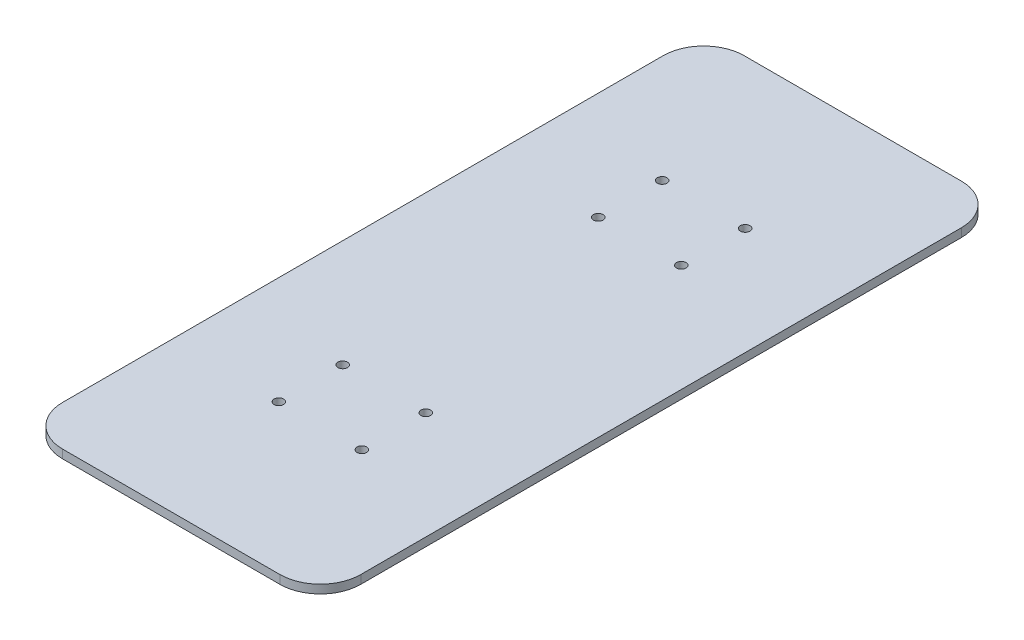
ISO-10303-21;
HEADER;
FILE_DESCRIPTION(('STEP AP214'),'2;1');
FILE_NAME('part.step','',(''),(''),'','','');
FILE_SCHEMA(('AUTOMOTIVE_DESIGN { 1 0 10303 214 1 1 1 1 }'));
ENDSEC;
DATA;
#1=APPLICATION_CONTEXT('core data for automotive mechanical design processes');
#2=APPLICATION_PROTOCOL_DEFINITION('international standard','automotive_design',2000,#1);
#3=PRODUCT_CONTEXT('',#1,'mechanical');
#4=PRODUCT('Part','Part','',(#3));
#5=PRODUCT_RELATED_PRODUCT_CATEGORY('part','',(#4));
#6=PRODUCT_DEFINITION_FORMATION('','',#4);
#7=PRODUCT_DEFINITION_CONTEXT('part definition',#1,'design');
#8=PRODUCT_DEFINITION('design','',#6,#7);
#9=PRODUCT_DEFINITION_SHAPE('','',#8);
#10=(LENGTH_UNIT() NAMED_UNIT(*) SI_UNIT(.MILLI.,.METRE.));
#11=(NAMED_UNIT(*) PLANE_ANGLE_UNIT() SI_UNIT($,.RADIAN.));
#12=(NAMED_UNIT(*) SI_UNIT($,.STERADIAN.) SOLID_ANGLE_UNIT());
#13=UNCERTAINTY_MEASURE_WITH_UNIT(LENGTH_MEASURE(1.E-05),#10,'distance_accuracy_value','');
#14=(GEOMETRIC_REPRESENTATION_CONTEXT(3) GLOBAL_UNCERTAINTY_ASSIGNED_CONTEXT((#13)) GLOBAL_UNIT_ASSIGNED_CONTEXT((#10,
#11,#12)) REPRESENTATION_CONTEXT('',''));
#15=CARTESIAN_POINT('',(0.,0.,0.));
#16=DIRECTION('',(0.,0.,1.));
#17=DIRECTION('',(1.,0.,0.));
#18=AXIS2_PLACEMENT_3D('',#15,#16,#17);
#19=CARTESIAN_POINT('',(0.,4.,0.));
#20=DIRECTION('',(1.,0.,0.));
#21=DIRECTION('',(0.,0.,-1.));
#22=AXIS2_PLACEMENT_3D('',#19,#20,#21);
#23=PLANE('',#22);
#24=DIRECTION('',(0.,0.,1.));
#25=VECTOR('',#24,1.);
#26=CARTESIAN_POINT('',(0.,4.,0.));
#27=LINE('',#26,#25);
#28=CARTESIAN_POINT('',(0.,4.,-301.));
#29=VERTEX_POINT('',#28);
#30=CARTESIAN_POINT('',(0.,4.,-19.));
#31=VERTEX_POINT('',#30);
#32=EDGE_CURVE('E117',#29,#31,#27,.T.);
#33=ORIENTED_EDGE('',*,*,#32,.F.);
#34=DIRECTION('',(0.,-1.,0.));
#35=VECTOR('',#34,1.);
#36=CARTESIAN_POINT('',(0.,4.,-301.));
#37=LINE('',#36,#35);
#38=CARTESIAN_POINT('',(0.,0.,-301.));
#39=VERTEX_POINT('',#38);
#40=EDGE_CURVE('E102',#29,#39,#37,.T.);
#41=ORIENTED_EDGE('',*,*,#40,.T.);
#42=DIRECTION('',(0.,0.,1.));
#43=VECTOR('',#42,1.);
#44=CARTESIAN_POINT('',(0.,0.,0.));
#45=LINE('',#44,#43);
#46=CARTESIAN_POINT('',(0.,0.,-19.));
#47=VERTEX_POINT('',#46);
#48=EDGE_CURVE('E114',#39,#47,#45,.T.);
#49=ORIENTED_EDGE('',*,*,#48,.T.);
#50=DIRECTION('',(0.,-1.,0.));
#51=VECTOR('',#50,1.);
#52=CARTESIAN_POINT('',(0.,4.,-19.));
#53=LINE('',#52,#51);
#54=EDGE_CURVE('E119',#47,#31,#53,.F.);
#55=ORIENTED_EDGE('',*,*,#54,.T.);
#56=EDGE_LOOP('',(#33,#41,#49,#55));
#57=FACE_BOUND('',#56,.T.);
#58=ADVANCED_FACE('F32',(#57),#23,.F.);
#59=CARTESIAN_POINT('',(0.,4.,0.));
#60=DIRECTION('',(0.,0.,-1.));
#61=DIRECTION('',(-1.,0.,0.));
#62=AXIS2_PLACEMENT_3D('',#59,#60,#61);
#63=PLANE('',#62);
#64=DIRECTION('',(1.,0.,0.));
#65=VECTOR('',#64,1.);
#66=CARTESIAN_POINT('',(0.,0.,0.));
#67=LINE('',#66,#65);
#68=CARTESIAN_POINT('',(19.,0.,0.));
#69=VERTEX_POINT('',#68);
#70=CARTESIAN_POINT('',(121.,0.,0.));
#71=VERTEX_POINT('',#70);
#72=EDGE_CURVE('E123',#69,#71,#67,.T.);
#73=ORIENTED_EDGE('',*,*,#72,.T.);
#74=DIRECTION('',(0.,-1.,0.));
#75=VECTOR('',#74,1.);
#76=CARTESIAN_POINT('',(121.,4.,0.));
#77=LINE('',#76,#75);
#78=CARTESIAN_POINT('',(121.,4.,0.));
#79=VERTEX_POINT('',#78);
#80=EDGE_CURVE('E11',#71,#79,#77,.F.);
#81=ORIENTED_EDGE('',*,*,#80,.T.);
#82=DIRECTION('',(1.,0.,0.));
#83=VECTOR('',#82,1.);
#84=CARTESIAN_POINT('',(0.,4.,0.));
#85=LINE('',#84,#83);
#86=CARTESIAN_POINT('',(19.,4.,0.));
#87=VERTEX_POINT('',#86);
#88=EDGE_CURVE('E163',#87,#79,#85,.T.);
#89=ORIENTED_EDGE('',*,*,#88,.F.);
#90=DIRECTION('',(0.,-1.,0.));
#91=VECTOR('',#90,1.);
#92=CARTESIAN_POINT('',(19.,4.,0.));
#93=LINE('',#92,#91);
#94=EDGE_CURVE('E40',#87,#69,#93,.T.);
#95=ORIENTED_EDGE('',*,*,#94,.T.);
#96=EDGE_LOOP('',(#73,#81,#89,#95));
#97=FACE_BOUND('',#96,.T.);
#98=ADVANCED_FACE('F161',(#97),#63,.F.);
#99=CARTESIAN_POINT('',(140.,4.,0.));
#100=DIRECTION('',(-1.,0.,0.));
#101=DIRECTION('',(0.,0.,1.));
#102=AXIS2_PLACEMENT_3D('',#99,#100,#101);
#103=PLANE('',#102);
#104=DIRECTION('',(0.,0.,-1.));
#105=VECTOR('',#104,1.);
#106=CARTESIAN_POINT('',(140.,0.,0.));
#107=LINE('',#106,#105);
#108=CARTESIAN_POINT('',(140.,0.,-19.));
#109=VERTEX_POINT('',#108);
#110=CARTESIAN_POINT('',(140.,0.,-301.));
#111=VERTEX_POINT('',#110);
#112=EDGE_CURVE('E127',#109,#111,#107,.T.);
#113=ORIENTED_EDGE('',*,*,#112,.T.);
#114=DIRECTION('',(0.,-1.,0.));
#115=VECTOR('',#114,1.);
#116=CARTESIAN_POINT('',(140.,4.,-301.));
#117=LINE('',#116,#115);
#118=CARTESIAN_POINT('',(140.,4.,-301.));
#119=VERTEX_POINT('',#118);
#120=EDGE_CURVE('E47',#111,#119,#117,.F.);
#121=ORIENTED_EDGE('',*,*,#120,.T.);
#122=DIRECTION('',(0.,0.,-1.));
#123=VECTOR('',#122,1.);
#124=CARTESIAN_POINT('',(140.,4.,0.));
#125=LINE('',#124,#123);
#126=CARTESIAN_POINT('',(140.,4.,-19.));
#127=VERTEX_POINT('',#126);
#128=EDGE_CURVE('E171',#127,#119,#125,.T.);
#129=ORIENTED_EDGE('',*,*,#128,.F.);
#130=DIRECTION('',(0.,-1.,0.));
#131=VECTOR('',#130,1.);
#132=CARTESIAN_POINT('',(140.,4.,-19.));
#133=LINE('',#132,#131);
#134=EDGE_CURVE('E154',#127,#109,#133,.T.);
#135=ORIENTED_EDGE('',*,*,#134,.T.);
#136=EDGE_LOOP('',(#113,#121,#129,#135));
#137=FACE_BOUND('',#136,.T.);
#138=ADVANCED_FACE('F170',(#137),#103,.F.);
#139=CARTESIAN_POINT('',(0.,4.,-320.));
#140=DIRECTION('',(0.,0.,1.));
#141=DIRECTION('',(1.,0.,0.));
#142=AXIS2_PLACEMENT_3D('',#139,#140,#141);
#143=PLANE('',#142);
#144=DIRECTION('',(-1.,0.,0.));
#145=VECTOR('',#144,1.);
#146=CARTESIAN_POINT('',(0.,0.,-320.));
#147=LINE('',#146,#145);
#148=CARTESIAN_POINT('',(121.,0.,-320.));
#149=VERTEX_POINT('',#148);
#150=CARTESIAN_POINT('',(18.9999999999999,0.,-320.));
#151=VERTEX_POINT('',#150);
#152=EDGE_CURVE('E137',#149,#151,#147,.T.);
#153=ORIENTED_EDGE('',*,*,#152,.T.);
#154=DIRECTION('',(0.,-1.,0.));
#155=VECTOR('',#154,1.);
#156=CARTESIAN_POINT('',(18.9999999999999,4.,-320.));
#157=LINE('',#156,#155);
#158=CARTESIAN_POINT('',(18.9999999999999,4.,-320.));
#159=VERTEX_POINT('',#158);
#160=EDGE_CURVE('E103',#151,#159,#157,.F.);
#161=ORIENTED_EDGE('',*,*,#160,.T.);
#162=DIRECTION('',(-1.,0.,0.));
#163=VECTOR('',#162,1.);
#164=CARTESIAN_POINT('',(0.,4.,-320.));
#165=LINE('',#164,#163);
#166=CARTESIAN_POINT('',(121.,4.,-320.));
#167=VERTEX_POINT('',#166);
#168=EDGE_CURVE('E133',#167,#159,#165,.T.);
#169=ORIENTED_EDGE('',*,*,#168,.F.);
#170=DIRECTION('',(0.,-1.,0.));
#171=VECTOR('',#170,1.);
#172=CARTESIAN_POINT('',(121.,4.,-320.));
#173=LINE('',#172,#171);
#174=EDGE_CURVE('E108',#167,#149,#173,.T.);
#175=ORIENTED_EDGE('',*,*,#174,.T.);
#176=EDGE_LOOP('',(#153,#161,#169,#175));
#177=FACE_BOUND('',#176,.T.);
#178=ADVANCED_FACE('F227',(#177),#143,.F.);
#179=CARTESIAN_POINT('',(0.,4.,0.));
#180=DIRECTION('',(0.,-1.,0.));
#181=DIRECTION('',(0.,0.,-1.));
#182=AXIS2_PLACEMENT_3D('',#179,#180,#181);
#183=PLANE('',#182);
#184=CARTESIAN_POINT('',(89.5,4.,-220.));
#185=DIRECTION('',(0.,1.,0.));
#186=DIRECTION('',(0.,0.,1.));
#187=AXIS2_PLACEMENT_3D('',#184,#185,#186);
#188=CIRCLE('',#187,2.25);
#189=CARTESIAN_POINT('',(89.5,4.,-217.75));
#190=VERTEX_POINT('',#189);
#191=EDGE_CURVE('E178',#190,#190,#188,.T.);
#192=ORIENTED_EDGE('',*,*,#191,.F.);
#193=EDGE_LOOP('',(#192));
#194=FACE_BOUND('',#193,.T.);
#195=CARTESIAN_POINT('',(89.5,4.,-100.));
#196=DIRECTION('',(0.,1.,0.));
#197=DIRECTION('',(0.,0.,1.));
#198=AXIS2_PLACEMENT_3D('',#195,#196,#197);
#199=CIRCLE('',#198,2.25);
#200=CARTESIAN_POINT('',(89.5,4.,-97.75));
#201=VERTEX_POINT('',#200);
#202=EDGE_CURVE('E196',#201,#201,#199,.T.);
#203=ORIENTED_EDGE('',*,*,#202,.F.);
#204=EDGE_LOOP('',(#203));
#205=FACE_BOUND('',#204,.T.);
#206=CARTESIAN_POINT('',(89.5,4.,-70.0000000000001));
#207=DIRECTION('',(0.,1.,0.));
#208=DIRECTION('',(0.,0.,1.));
#209=AXIS2_PLACEMENT_3D('',#206,#207,#208);
#210=CIRCLE('',#209,2.25);
#211=CARTESIAN_POINT('',(89.5,4.,-67.7500000000001));
#212=VERTEX_POINT('',#211);
#213=EDGE_CURVE('E190',#212,#212,#210,.T.);
#214=ORIENTED_EDGE('',*,*,#213,.F.);
#215=EDGE_LOOP('',(#214));
#216=FACE_BOUND('',#215,.T.);
#217=CARTESIAN_POINT('',(50.5,4.,-70.0000000000001));
#218=DIRECTION('',(0.,1.,0.));
#219=DIRECTION('',(0.,0.,-1.));
#220=AXIS2_PLACEMENT_3D('',#217,#218,#219);
#221=CIRCLE('',#220,2.25);
#222=CARTESIAN_POINT('',(50.5,4.,-72.2500000000001));
#223=VERTEX_POINT('',#222);
#224=EDGE_CURVE('E183',#223,#223,#221,.T.);
#225=ORIENTED_EDGE('',*,*,#224,.F.);
#226=EDGE_LOOP('',(#225));
#227=FACE_BOUND('',#226,.T.);
#228=CARTESIAN_POINT('',(50.5,4.,-100.));
#229=DIRECTION('',(0.,1.,0.));
#230=DIRECTION('',(0.,0.,-1.));
#231=AXIS2_PLACEMENT_3D('',#228,#229,#230);
#232=CIRCLE('',#231,2.25);
#233=CARTESIAN_POINT('',(50.5,4.,-102.25));
#234=VERTEX_POINT('',#233);
#235=EDGE_CURVE('E184',#234,#234,#232,.T.);
#236=ORIENTED_EDGE('',*,*,#235,.F.);
#237=EDGE_LOOP('',(#236));
#238=FACE_BOUND('',#237,.T.);
#239=CARTESIAN_POINT('',(50.5,4.,-220.));
#240=DIRECTION('',(0.,1.,0.));
#241=DIRECTION('',(0.,0.,-1.));
#242=AXIS2_PLACEMENT_3D('',#239,#240,#241);
#243=CIRCLE('',#242,2.25);
#244=CARTESIAN_POINT('',(50.5,4.,-222.25));
#245=VERTEX_POINT('',#244);
#246=EDGE_CURVE('E213',#245,#245,#243,.T.);
#247=ORIENTED_EDGE('',*,*,#246,.F.);
#248=EDGE_LOOP('',(#247));
#249=FACE_BOUND('',#248,.T.);
#250=CARTESIAN_POINT('',(50.5,4.,-250.));
#251=DIRECTION('',(0.,1.,0.));
#252=DIRECTION('',(0.,0.,-1.));
#253=AXIS2_PLACEMENT_3D('',#250,#251,#252);
#254=CIRCLE('',#253,2.25);
#255=CARTESIAN_POINT('',(50.5,4.,-252.25));
#256=VERTEX_POINT('',#255);
#257=EDGE_CURVE('E207',#256,#256,#254,.T.);
#258=ORIENTED_EDGE('',*,*,#257,.F.);
#259=EDGE_LOOP('',(#258));
#260=FACE_BOUND('',#259,.T.);
#261=CARTESIAN_POINT('',(89.5,4.,-250.));
#262=DIRECTION('',(0.,1.,0.));
#263=DIRECTION('',(0.,0.,1.));
#264=AXIS2_PLACEMENT_3D('',#261,#262,#263);
#265=CIRCLE('',#264,2.25);
#266=CARTESIAN_POINT('',(89.5,4.,-247.75));
#267=VERTEX_POINT('',#266);
#268=EDGE_CURVE('E124',#267,#267,#265,.T.);
#269=ORIENTED_EDGE('',*,*,#268,.F.);
#270=EDGE_LOOP('',(#269));
#271=FACE_BOUND('',#270,.T.);
#272=ORIENTED_EDGE('',*,*,#168,.T.);
#273=CARTESIAN_POINT('',(18.9999999999999,4.,-301.));
#274=DIRECTION('',(0.,-1.,0.));
#275=DIRECTION('',(0.,0.,-1.));
#276=AXIS2_PLACEMENT_3D('',#273,#274,#275);
#277=CIRCLE('',#276,19.);
#278=EDGE_CURVE('E152',#159,#29,#277,.F.);
#279=ORIENTED_EDGE('',*,*,#278,.T.);
#280=ORIENTED_EDGE('',*,*,#32,.T.);
#281=CARTESIAN_POINT('',(19.,4.,-19.));
#282=DIRECTION('',(0.,-1.,0.));
#283=DIRECTION('',(0.,0.,-1.));
#284=AXIS2_PLACEMENT_3D('',#281,#282,#283);
#285=CIRCLE('',#284,19.);
#286=EDGE_CURVE('E147',#31,#87,#285,.F.);
#287=ORIENTED_EDGE('',*,*,#286,.T.);
#288=ORIENTED_EDGE('',*,*,#88,.T.);
#289=CARTESIAN_POINT('',(121.,4.,-19.));
#290=DIRECTION('',(0.,-1.,0.));
#291=DIRECTION('',(0.,0.,-1.));
#292=AXIS2_PLACEMENT_3D('',#289,#290,#291);
#293=CIRCLE('',#292,19.);
#294=EDGE_CURVE('E54',#79,#127,#293,.F.);
#295=ORIENTED_EDGE('',*,*,#294,.T.);
#296=ORIENTED_EDGE('',*,*,#128,.T.);
#297=CARTESIAN_POINT('',(121.,4.,-301.));
#298=DIRECTION('',(0.,-1.,0.));
#299=DIRECTION('',(0.,0.,-1.));
#300=AXIS2_PLACEMENT_3D('',#297,#298,#299);
#301=CIRCLE('',#300,19.);
#302=EDGE_CURVE('E150',#119,#167,#301,.F.);
#303=ORIENTED_EDGE('',*,*,#302,.T.);
#304=EDGE_LOOP('',(#272,#279,#280,#287,#288,#295,#296,#303));
#305=FACE_BOUND('',#304,.T.);
#306=ADVANCED_FACE('F224',(#194,#205,#216,#227,#238,#249,#260,#271,#305),#183,.F.);
#307=CARTESIAN_POINT('',(0.,0.,0.));
#308=DIRECTION('',(0.,-1.,0.));
#309=DIRECTION('',(0.,0.,-1.));
#310=AXIS2_PLACEMENT_3D('',#307,#308,#309);
#311=PLANE('',#310);
#312=CARTESIAN_POINT('',(89.5,0.,-220.));
#313=DIRECTION('',(0.,-1.,0.));
#314=DIRECTION('',(0.,0.,-1.));
#315=AXIS2_PLACEMENT_3D('',#312,#313,#314);
#316=CIRCLE('',#315,2.25);
#317=CARTESIAN_POINT('',(89.5,0.,-222.25));
#318=VERTEX_POINT('',#317);
#319=EDGE_CURVE('E199',#318,#318,#316,.F.);
#320=ORIENTED_EDGE('',*,*,#319,.T.);
#321=EDGE_LOOP('',(#320));
#322=FACE_BOUND('',#321,.T.);
#323=CARTESIAN_POINT('',(89.5,0.,-100.));
#324=DIRECTION('',(0.,-1.,0.));
#325=DIRECTION('',(0.,0.,-1.));
#326=AXIS2_PLACEMENT_3D('',#323,#324,#325);
#327=CIRCLE('',#326,2.25);
#328=CARTESIAN_POINT('',(89.5,0.,-102.25));
#329=VERTEX_POINT('',#328);
#330=EDGE_CURVE('E193',#329,#329,#327,.F.);
#331=ORIENTED_EDGE('',*,*,#330,.T.);
#332=EDGE_LOOP('',(#331));
#333=FACE_BOUND('',#332,.T.);
#334=CARTESIAN_POINT('',(89.5,0.,-70.0000000000001));
#335=DIRECTION('',(0.,-1.,0.));
#336=DIRECTION('',(0.,0.,-1.));
#337=AXIS2_PLACEMENT_3D('',#334,#335,#336);
#338=CIRCLE('',#337,2.25);
#339=CARTESIAN_POINT('',(89.5,0.,-72.2500000000001));
#340=VERTEX_POINT('',#339);
#341=EDGE_CURVE('E187',#340,#340,#338,.F.);
#342=ORIENTED_EDGE('',*,*,#341,.T.);
#343=EDGE_LOOP('',(#342));
#344=FACE_BOUND('',#343,.T.);
#345=CARTESIAN_POINT('',(50.5,0.,-70.0000000000001));
#346=DIRECTION('',(0.,-1.,0.));
#347=DIRECTION('',(0.,0.,-1.));
#348=AXIS2_PLACEMENT_3D('',#345,#346,#347);
#349=CIRCLE('',#348,2.25);
#350=CARTESIAN_POINT('',(50.5,0.,-72.2500000000001));
#351=VERTEX_POINT('',#350);
#352=EDGE_CURVE('E180',#351,#351,#349,.F.);
#353=ORIENTED_EDGE('',*,*,#352,.T.);
#354=EDGE_LOOP('',(#353));
#355=FACE_BOUND('',#354,.T.);
#356=CARTESIAN_POINT('',(50.5,0.,-100.));
#357=DIRECTION('',(0.,-1.,0.));
#358=DIRECTION('',(0.,0.,-1.));
#359=AXIS2_PLACEMENT_3D('',#356,#357,#358);
#360=CIRCLE('',#359,2.25);
#361=CARTESIAN_POINT('',(50.5,0.,-102.25));
#362=VERTEX_POINT('',#361);
#363=EDGE_CURVE('E216',#362,#362,#360,.F.);
#364=ORIENTED_EDGE('',*,*,#363,.T.);
#365=EDGE_LOOP('',(#364));
#366=FACE_BOUND('',#365,.T.);
#367=CARTESIAN_POINT('',(50.5,0.,-220.));
#368=DIRECTION('',(0.,-1.,0.));
#369=DIRECTION('',(0.,0.,-1.));
#370=AXIS2_PLACEMENT_3D('',#367,#368,#369);
#371=CIRCLE('',#370,2.25);
#372=CARTESIAN_POINT('',(50.5,0.,-222.25));
#373=VERTEX_POINT('',#372);
#374=EDGE_CURVE('E210',#373,#373,#371,.F.);
#375=ORIENTED_EDGE('',*,*,#374,.T.);
#376=EDGE_LOOP('',(#375));
#377=FACE_BOUND('',#376,.T.);
#378=CARTESIAN_POINT('',(50.5,0.,-250.));
#379=DIRECTION('',(0.,-1.,0.));
#380=DIRECTION('',(0.,0.,-1.));
#381=AXIS2_PLACEMENT_3D('',#378,#379,#380);
#382=CIRCLE('',#381,2.25);
#383=CARTESIAN_POINT('',(50.5,0.,-252.25));
#384=VERTEX_POINT('',#383);
#385=EDGE_CURVE('E204',#384,#384,#382,.F.);
#386=ORIENTED_EDGE('',*,*,#385,.T.);
#387=EDGE_LOOP('',(#386));
#388=FACE_BOUND('',#387,.T.);
#389=CARTESIAN_POINT('',(89.5,0.,-250.));
#390=DIRECTION('',(0.,-1.,0.));
#391=DIRECTION('',(0.,0.,-1.));
#392=AXIS2_PLACEMENT_3D('',#389,#390,#391);
#393=CIRCLE('',#392,2.25);
#394=CARTESIAN_POINT('',(89.5,0.,-252.25));
#395=VERTEX_POINT('',#394);
#396=EDGE_CURVE('E130',#395,#395,#393,.F.);
#397=ORIENTED_EDGE('',*,*,#396,.T.);
#398=EDGE_LOOP('',(#397));
#399=FACE_BOUND('',#398,.T.);
#400=ORIENTED_EDGE('',*,*,#48,.F.);
#401=CARTESIAN_POINT('',(18.9999999999999,0.,-301.));
#402=DIRECTION('',(0.,-1.,0.));
#403=DIRECTION('',(0.,0.,-1.));
#404=AXIS2_PLACEMENT_3D('',#401,#402,#403);
#405=CIRCLE('',#404,19.);
#406=EDGE_CURVE('E98',#39,#151,#405,.T.);
#407=ORIENTED_EDGE('',*,*,#406,.T.);
#408=ORIENTED_EDGE('',*,*,#152,.F.);
#409=CARTESIAN_POINT('',(121.,0.,-301.));
#410=DIRECTION('',(0.,-1.,0.));
#411=DIRECTION('',(0.,0.,-1.));
#412=AXIS2_PLACEMENT_3D('',#409,#410,#411);
#413=CIRCLE('',#412,19.);
#414=EDGE_CURVE('E109',#149,#111,#413,.T.);
#415=ORIENTED_EDGE('',*,*,#414,.T.);
#416=ORIENTED_EDGE('',*,*,#112,.F.);
#417=CARTESIAN_POINT('',(121.,0.,-19.));
#418=DIRECTION('',(0.,-1.,0.));
#419=DIRECTION('',(0.,0.,-1.));
#420=AXIS2_PLACEMENT_3D('',#417,#418,#419);
#421=CIRCLE('',#420,19.);
#422=EDGE_CURVE('E141',#109,#71,#421,.T.);
#423=ORIENTED_EDGE('',*,*,#422,.T.);
#424=ORIENTED_EDGE('',*,*,#72,.F.);
#425=CARTESIAN_POINT('',(19.,0.,-19.));
#426=DIRECTION('',(0.,-1.,0.));
#427=DIRECTION('',(0.,0.,-1.));
#428=AXIS2_PLACEMENT_3D('',#425,#426,#427);
#429=CIRCLE('',#428,19.);
#430=EDGE_CURVE('E118',#69,#47,#429,.T.);
#431=ORIENTED_EDGE('',*,*,#430,.T.);
#432=EDGE_LOOP('',(#400,#407,#408,#415,#416,#423,#424,#431));
#433=FACE_BOUND('',#432,.T.);
#434=ADVANCED_FACE('F121',(#322,#333,#344,#355,#366,#377,#388,#399,#433),#311,.T.);
#435=CARTESIAN_POINT('',(89.5,-0.00100000000000013,-250.));
#436=DIRECTION('',(0.,1.,0.));
#437=DIRECTION('',(0.,0.,1.));
#438=AXIS2_PLACEMENT_3D('',#435,#436,#437);
#439=CYLINDRICAL_SURFACE('',#438,2.25);
#440=ORIENTED_EDGE('',*,*,#396,.F.);
#441=EDGE_LOOP('',(#440));
#442=FACE_BOUND('',#441,.T.);
#443=ORIENTED_EDGE('',*,*,#268,.T.);
#444=EDGE_LOOP('',(#443));
#445=FACE_BOUND('',#444,.T.);
#446=ADVANCED_FACE('F260',(#442,#445),#439,.F.);
#447=CARTESIAN_POINT('',(50.5,-0.00100000000000013,-250.));
#448=DIRECTION('',(0.,1.,0.));
#449=DIRECTION('',(0.,0.,1.));
#450=AXIS2_PLACEMENT_3D('',#447,#448,#449);
#451=CYLINDRICAL_SURFACE('',#450,2.25);
#452=ORIENTED_EDGE('',*,*,#385,.F.);
#453=EDGE_LOOP('',(#452));
#454=FACE_BOUND('',#453,.T.);
#455=ORIENTED_EDGE('',*,*,#257,.T.);
#456=EDGE_LOOP('',(#455));
#457=FACE_BOUND('',#456,.T.);
#458=ADVANCED_FACE('F265',(#454,#457),#451,.F.);
#459=CARTESIAN_POINT('',(50.5,-0.00100000000000013,-220.));
#460=DIRECTION('',(0.,1.,0.));
#461=DIRECTION('',(0.,0.,1.));
#462=AXIS2_PLACEMENT_3D('',#459,#460,#461);
#463=CYLINDRICAL_SURFACE('',#462,2.25);
#464=ORIENTED_EDGE('',*,*,#374,.F.);
#465=EDGE_LOOP('',(#464));
#466=FACE_BOUND('',#465,.T.);
#467=ORIENTED_EDGE('',*,*,#246,.T.);
#468=EDGE_LOOP('',(#467));
#469=FACE_BOUND('',#468,.T.);
#470=ADVANCED_FACE('F284',(#466,#469),#463,.F.);
#471=CARTESIAN_POINT('',(50.5,-0.00100000000000013,-100.));
#472=DIRECTION('',(0.,1.,0.));
#473=DIRECTION('',(0.,0.,1.));
#474=AXIS2_PLACEMENT_3D('',#471,#472,#473);
#475=CYLINDRICAL_SURFACE('',#474,2.25);
#476=ORIENTED_EDGE('',*,*,#363,.F.);
#477=EDGE_LOOP('',(#476));
#478=FACE_BOUND('',#477,.T.);
#479=ORIENTED_EDGE('',*,*,#235,.T.);
#480=EDGE_LOOP('',(#479));
#481=FACE_BOUND('',#480,.T.);
#482=ADVANCED_FACE('F222',(#478,#481),#475,.F.);
#483=CARTESIAN_POINT('',(50.5,-0.00100000000000013,-70.0000000000001));
#484=DIRECTION('',(0.,1.,0.));
#485=DIRECTION('',(0.,0.,1.));
#486=AXIS2_PLACEMENT_3D('',#483,#484,#485);
#487=CYLINDRICAL_SURFACE('',#486,2.25);
#488=ORIENTED_EDGE('',*,*,#352,.F.);
#489=EDGE_LOOP('',(#488));
#490=FACE_BOUND('',#489,.T.);
#491=ORIENTED_EDGE('',*,*,#224,.T.);
#492=EDGE_LOOP('',(#491));
#493=FACE_BOUND('',#492,.T.);
#494=ADVANCED_FACE('F267',(#490,#493),#487,.F.);
#495=CARTESIAN_POINT('',(89.5,-0.00100000000000013,-70.0000000000001));
#496=DIRECTION('',(0.,1.,0.));
#497=DIRECTION('',(0.,0.,1.));
#498=AXIS2_PLACEMENT_3D('',#495,#496,#497);
#499=CYLINDRICAL_SURFACE('',#498,2.25);
#500=ORIENTED_EDGE('',*,*,#341,.F.);
#501=EDGE_LOOP('',(#500));
#502=FACE_BOUND('',#501,.T.);
#503=ORIENTED_EDGE('',*,*,#213,.T.);
#504=EDGE_LOOP('',(#503));
#505=FACE_BOUND('',#504,.T.);
#506=ADVANCED_FACE('F270',(#502,#505),#499,.F.);
#507=CARTESIAN_POINT('',(89.5,-0.00100000000000013,-100.));
#508=DIRECTION('',(0.,1.,0.));
#509=DIRECTION('',(0.,0.,1.));
#510=AXIS2_PLACEMENT_3D('',#507,#508,#509);
#511=CYLINDRICAL_SURFACE('',#510,2.25);
#512=ORIENTED_EDGE('',*,*,#330,.F.);
#513=EDGE_LOOP('',(#512));
#514=FACE_BOUND('',#513,.T.);
#515=ORIENTED_EDGE('',*,*,#202,.T.);
#516=EDGE_LOOP('',(#515));
#517=FACE_BOUND('',#516,.T.);
#518=ADVANCED_FACE('F274',(#514,#517),#511,.F.);
#519=CARTESIAN_POINT('',(89.5,-0.00100000000000013,-220.));
#520=DIRECTION('',(0.,1.,0.));
#521=DIRECTION('',(0.,0.,1.));
#522=AXIS2_PLACEMENT_3D('',#519,#520,#521);
#523=CYLINDRICAL_SURFACE('',#522,2.25);
#524=ORIENTED_EDGE('',*,*,#319,.F.);
#525=EDGE_LOOP('',(#524));
#526=FACE_BOUND('',#525,.T.);
#527=ORIENTED_EDGE('',*,*,#191,.T.);
#528=EDGE_LOOP('',(#527));
#529=FACE_BOUND('',#528,.T.);
#530=ADVANCED_FACE('F246',(#526,#529),#523,.F.);
#531=CARTESIAN_POINT('',(18.9999999999999,4.,-301.));
#532=DIRECTION('',(0.,-1.,0.));
#533=DIRECTION('',(0.,0.,-1.));
#534=AXIS2_PLACEMENT_3D('',#531,#532,#533);
#535=CYLINDRICAL_SURFACE('',#534,19.);
#536=ORIENTED_EDGE('',*,*,#278,.F.);
#537=ORIENTED_EDGE('',*,*,#160,.F.);
#538=ORIENTED_EDGE('',*,*,#406,.F.);
#539=ORIENTED_EDGE('',*,*,#40,.F.);
#540=EDGE_LOOP('',(#536,#537,#538,#539));
#541=FACE_BOUND('',#540,.T.);
#542=ADVANCED_FACE('F101',(#541),#535,.T.);
#543=CARTESIAN_POINT('',(121.,4.,-301.));
#544=DIRECTION('',(0.,-1.,0.));
#545=DIRECTION('',(0.,0.,-1.));
#546=AXIS2_PLACEMENT_3D('',#543,#544,#545);
#547=CYLINDRICAL_SURFACE('',#546,19.);
#548=ORIENTED_EDGE('',*,*,#302,.F.);
#549=ORIENTED_EDGE('',*,*,#120,.F.);
#550=ORIENTED_EDGE('',*,*,#414,.F.);
#551=ORIENTED_EDGE('',*,*,#174,.F.);
#552=EDGE_LOOP('',(#548,#549,#550,#551));
#553=FACE_BOUND('',#552,.T.);
#554=ADVANCED_FACE('F239',(#553),#547,.T.);
#555=CARTESIAN_POINT('',(121.,4.,-19.));
#556=DIRECTION('',(0.,-1.,0.));
#557=DIRECTION('',(0.,0.,-1.));
#558=AXIS2_PLACEMENT_3D('',#555,#556,#557);
#559=CYLINDRICAL_SURFACE('',#558,19.);
#560=ORIENTED_EDGE('',*,*,#294,.F.);
#561=ORIENTED_EDGE('',*,*,#80,.F.);
#562=ORIENTED_EDGE('',*,*,#422,.F.);
#563=ORIENTED_EDGE('',*,*,#134,.F.);
#564=EDGE_LOOP('',(#560,#561,#562,#563));
#565=FACE_BOUND('',#564,.T.);
#566=ADVANCED_FACE('F169',(#565),#559,.T.);
#567=CARTESIAN_POINT('',(19.,4.,-19.));
#568=DIRECTION('',(0.,-1.,0.));
#569=DIRECTION('',(0.,0.,-1.));
#570=AXIS2_PLACEMENT_3D('',#567,#568,#569);
#571=CYLINDRICAL_SURFACE('',#570,19.);
#572=ORIENTED_EDGE('',*,*,#286,.F.);
#573=ORIENTED_EDGE('',*,*,#54,.F.);
#574=ORIENTED_EDGE('',*,*,#430,.F.);
#575=ORIENTED_EDGE('',*,*,#94,.F.);
#576=EDGE_LOOP('',(#572,#573,#574,#575));
#577=FACE_BOUND('',#576,.T.);
#578=ADVANCED_FACE('F34',(#577),#571,.T.);
#579=CLOSED_SHELL('',(#58,#98,#138,#178,#306,#434,#446,#458,#470,#482,#494,#506,#518,#530,#542,
#554,#566,#578));
#580=MANIFOLD_SOLID_BREP('B2',#579);
#581=ADVANCED_BREP_SHAPE_REPRESENTATION('',(#18,#580),#14);
#582=SHAPE_DEFINITION_REPRESENTATION(#9,#581);
ENDSEC;
END-ISO-10303-21;
